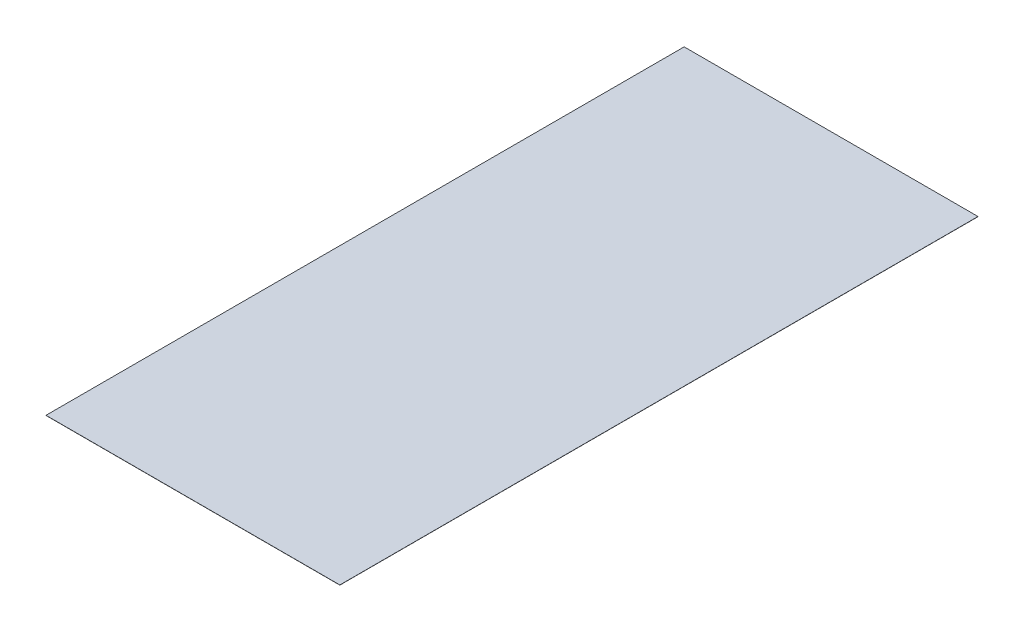
ISO-10303-21;
HEADER;
FILE_DESCRIPTION(('STEP AP214'),'2;1');
FILE_NAME('part.step','',(''),(''),'','','');
FILE_SCHEMA(('AUTOMOTIVE_DESIGN { 1 0 10303 214 1 1 1 1 }'));
ENDSEC;
DATA;
#1=APPLICATION_CONTEXT('core data for automotive mechanical design processes');
#2=APPLICATION_PROTOCOL_DEFINITION('international standard','automotive_design',2000,#1);
#3=PRODUCT_CONTEXT('',#1,'mechanical');
#4=PRODUCT('Part','Part','',(#3));
#5=PRODUCT_RELATED_PRODUCT_CATEGORY('part','',(#4));
#6=PRODUCT_DEFINITION_FORMATION('','',#4);
#7=PRODUCT_DEFINITION_CONTEXT('part definition',#1,'design');
#8=PRODUCT_DEFINITION('design','',#6,#7);
#9=PRODUCT_DEFINITION_SHAPE('','',#8);
#10=(LENGTH_UNIT() NAMED_UNIT(*) SI_UNIT(.MILLI.,.METRE.));
#11=(NAMED_UNIT(*) PLANE_ANGLE_UNIT() SI_UNIT($,.RADIAN.));
#12=(NAMED_UNIT(*) SI_UNIT($,.STERADIAN.) SOLID_ANGLE_UNIT());
#13=UNCERTAINTY_MEASURE_WITH_UNIT(LENGTH_MEASURE(1.E-05),#10,'distance_accuracy_value','');
#14=(GEOMETRIC_REPRESENTATION_CONTEXT(3) GLOBAL_UNCERTAINTY_ASSIGNED_CONTEXT((#13)) GLOBAL_UNIT_ASSIGNED_CONTEXT((#10,
#11,#12)) REPRESENTATION_CONTEXT('',''));
#15=CARTESIAN_POINT('',(0.,0.,0.));
#16=DIRECTION('',(0.,0.,1.));
#17=DIRECTION('',(1.,0.,0.));
#18=AXIS2_PLACEMENT_3D('',#15,#16,#17);
#19=CARTESIAN_POINT('',(0.,0.3175,0.));
#20=DIRECTION('',(1.,0.,0.));
#21=DIRECTION('',(0.,0.,-1.));
#22=AXIS2_PLACEMENT_3D('',#19,#20,#21);
#23=PLANE('',#22);
#24=DIRECTION('',(0.,0.,1.));
#25=VECTOR('',#24,1.);
#26=CARTESIAN_POINT('',(0.,0.,0.));
#27=LINE('',#26,#25);
#28=CARTESIAN_POINT('',(0.,0.,-1165.076918));
#29=VERTEX_POINT('',#28);
#30=CARTESIAN_POINT('',(0.,0.,0.));
#31=VERTEX_POINT('',#30);
#32=EDGE_CURVE('E97',#29,#31,#27,.T.);
#33=ORIENTED_EDGE('',*,*,#32,.T.);
#34=DIRECTION('',(0.,-1.,0.));
#35=VECTOR('',#34,1.);
#36=CARTESIAN_POINT('',(0.,0.3175,0.));
#37=LINE('',#36,#35);
#38=CARTESIAN_POINT('',(0.,0.3175,0.));
#39=VERTEX_POINT('',#38);
#40=EDGE_CURVE('E11',#39,#31,#37,.T.);
#41=ORIENTED_EDGE('',*,*,#40,.F.);
#42=DIRECTION('',(0.,0.,1.));
#43=VECTOR('',#42,1.);
#44=CARTESIAN_POINT('',(0.,0.3175,0.));
#45=LINE('',#44,#43);
#46=CARTESIAN_POINT('',(0.,0.3175,-1165.076918));
#47=VERTEX_POINT('',#46);
#48=EDGE_CURVE('E85',#47,#39,#45,.T.);
#49=ORIENTED_EDGE('',*,*,#48,.F.);
#50=DIRECTION('',(0.,-1.,0.));
#51=VECTOR('',#50,1.);
#52=CARTESIAN_POINT('',(0.,0.3175,-1165.076918));
#53=LINE('',#52,#51);
#54=EDGE_CURVE('E93',#47,#29,#53,.T.);
#55=ORIENTED_EDGE('',*,*,#54,.T.);
#56=EDGE_LOOP('',(#33,#41,#49,#55));
#57=FACE_BOUND('',#56,.T.);
#58=ADVANCED_FACE('F34',(#57),#23,.F.);
#59=CARTESIAN_POINT('',(0.,0.3175,0.));
#60=DIRECTION('',(0.,0.,-1.));
#61=DIRECTION('',(-1.,0.,0.));
#62=AXIS2_PLACEMENT_3D('',#59,#60,#61);
#63=PLANE('',#62);
#64=DIRECTION('',(1.,0.,0.));
#65=VECTOR('',#64,1.);
#66=CARTESIAN_POINT('',(0.,0.,0.));
#67=LINE('',#66,#65);
#68=CARTESIAN_POINT('',(536.448,0.,0.));
#69=VERTEX_POINT('',#68);
#70=EDGE_CURVE('E89',#31,#69,#67,.T.);
#71=ORIENTED_EDGE('',*,*,#70,.T.);
#72=DIRECTION('',(0.,-1.,0.));
#73=VECTOR('',#72,1.);
#74=CARTESIAN_POINT('',(536.448,0.3175,0.));
#75=LINE('',#74,#73);
#76=CARTESIAN_POINT('',(536.448,0.3175,0.));
#77=VERTEX_POINT('',#76);
#78=EDGE_CURVE('E42',#77,#69,#75,.T.);
#79=ORIENTED_EDGE('',*,*,#78,.F.);
#80=DIRECTION('',(1.,0.,0.));
#81=VECTOR('',#80,1.);
#82=CARTESIAN_POINT('',(0.,0.3175,0.));
#83=LINE('',#82,#81);
#84=EDGE_CURVE('E80',#39,#77,#83,.T.);
#85=ORIENTED_EDGE('',*,*,#84,.F.);
#86=ORIENTED_EDGE('',*,*,#40,.T.);
#87=EDGE_LOOP('',(#71,#79,#85,#86));
#88=FACE_BOUND('',#87,.T.);
#89=ADVANCED_FACE('F88',(#88),#63,.F.);
#90=CARTESIAN_POINT('',(536.448,0.3175,0.));
#91=DIRECTION('',(-1.,0.,0.));
#92=DIRECTION('',(0.,0.,1.));
#93=AXIS2_PLACEMENT_3D('',#90,#91,#92);
#94=PLANE('',#93);
#95=DIRECTION('',(0.,0.,-1.));
#96=VECTOR('',#95,1.);
#97=CARTESIAN_POINT('',(536.448,0.,0.));
#98=LINE('',#97,#96);
#99=CARTESIAN_POINT('',(536.448,0.,-1165.076918));
#100=VERTEX_POINT('',#99);
#101=EDGE_CURVE('E67',#69,#100,#98,.T.);
#102=ORIENTED_EDGE('',*,*,#101,.T.);
#103=DIRECTION('',(0.,-1.,0.));
#104=VECTOR('',#103,1.);
#105=CARTESIAN_POINT('',(536.448,0.3175,-1165.076918));
#106=LINE('',#105,#104);
#107=CARTESIAN_POINT('',(536.448,0.3175,-1165.076918));
#108=VERTEX_POINT('',#107);
#109=EDGE_CURVE('E90',#108,#100,#106,.T.);
#110=ORIENTED_EDGE('',*,*,#109,.F.);
#111=DIRECTION('',(0.,0.,-1.));
#112=VECTOR('',#111,1.);
#113=CARTESIAN_POINT('',(536.448,0.3175,0.));
#114=LINE('',#113,#112);
#115=EDGE_CURVE('E83',#77,#108,#114,.T.);
#116=ORIENTED_EDGE('',*,*,#115,.F.);
#117=ORIENTED_EDGE('',*,*,#78,.T.);
#118=EDGE_LOOP('',(#102,#110,#116,#117));
#119=FACE_BOUND('',#118,.T.);
#120=ADVANCED_FACE('F91',(#119),#94,.F.);
#121=CARTESIAN_POINT('',(0.,0.3175,-1165.076918));
#122=DIRECTION('',(0.,0.,1.));
#123=DIRECTION('',(1.,0.,0.));
#124=AXIS2_PLACEMENT_3D('',#121,#122,#123);
#125=PLANE('',#124);
#126=DIRECTION('',(-1.,0.,0.));
#127=VECTOR('',#126,1.);
#128=CARTESIAN_POINT('',(0.,0.,-1165.076918));
#129=LINE('',#128,#127);
#130=EDGE_CURVE('E73',#100,#29,#129,.T.);
#131=ORIENTED_EDGE('',*,*,#130,.T.);
#132=ORIENTED_EDGE('',*,*,#54,.F.);
#133=DIRECTION('',(-1.,0.,0.));
#134=VECTOR('',#133,1.);
#135=CARTESIAN_POINT('',(0.,0.3175,-1165.076918));
#136=LINE('',#135,#134);
#137=EDGE_CURVE('E50',#108,#47,#136,.T.);
#138=ORIENTED_EDGE('',*,*,#137,.F.);
#139=ORIENTED_EDGE('',*,*,#109,.T.);
#140=EDGE_LOOP('',(#131,#132,#138,#139));
#141=FACE_BOUND('',#140,.T.);
#142=ADVANCED_FACE('F104',(#141),#125,.F.);
#143=CARTESIAN_POINT('',(0.,0.3175,0.));
#144=DIRECTION('',(0.,-1.,0.));
#145=DIRECTION('',(0.,0.,-1.));
#146=AXIS2_PLACEMENT_3D('',#143,#144,#145);
#147=PLANE('',#146);
#148=ORIENTED_EDGE('',*,*,#48,.T.);
#149=ORIENTED_EDGE('',*,*,#84,.T.);
#150=ORIENTED_EDGE('',*,*,#115,.T.);
#151=ORIENTED_EDGE('',*,*,#137,.T.);
#152=EDGE_LOOP('',(#148,#149,#150,#151));
#153=FACE_BOUND('',#152,.T.);
#154=ADVANCED_FACE('F81',(#153),#147,.F.);
#155=CARTESIAN_POINT('',(0.,0.,0.));
#156=DIRECTION('',(0.,-1.,0.));
#157=DIRECTION('',(0.,0.,-1.));
#158=AXIS2_PLACEMENT_3D('',#155,#156,#157);
#159=PLANE('',#158);
#160=ORIENTED_EDGE('',*,*,#32,.F.);
#161=ORIENTED_EDGE('',*,*,#130,.F.);
#162=ORIENTED_EDGE('',*,*,#101,.F.);
#163=ORIENTED_EDGE('',*,*,#70,.F.);
#164=EDGE_LOOP('',(#160,#161,#162,#163));
#165=FACE_BOUND('',#164,.T.);
#166=ADVANCED_FACE('F107',(#165),#159,.T.);
#167=CLOSED_SHELL('',(#58,#89,#120,#142,#154,#166));
#168=MANIFOLD_SOLID_BREP('B2',#167);
#169=ADVANCED_BREP_SHAPE_REPRESENTATION('',(#18,#168),#14);
#170=SHAPE_DEFINITION_REPRESENTATION(#9,#169);
ENDSEC;
END-ISO-10303-21;
